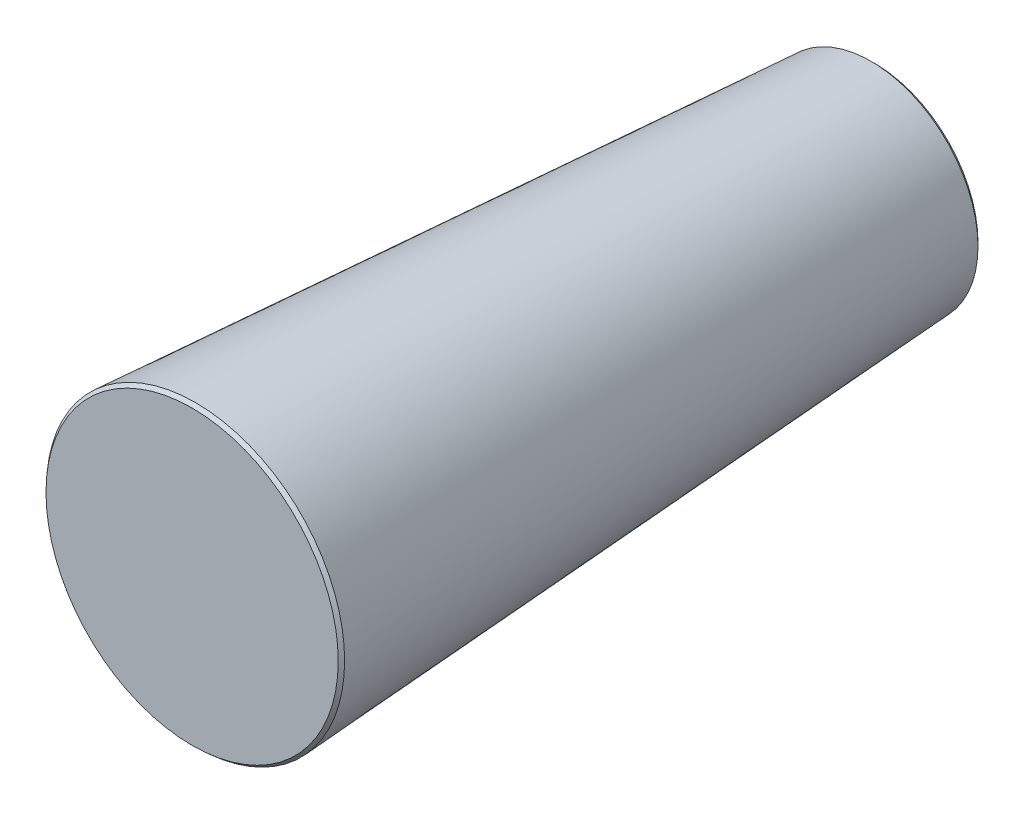
ISO-10303-21;
HEADER;
FILE_DESCRIPTION(('STEP AP214'),'2;1');
FILE_NAME('part.step','',(''),(''),'','','');
FILE_SCHEMA(('AUTOMOTIVE_DESIGN { 1 0 10303 214 1 1 1 1 }'));
ENDSEC;
DATA;
#1=APPLICATION_CONTEXT('core data for automotive mechanical design processes');
#2=APPLICATION_PROTOCOL_DEFINITION('international standard','automotive_design',2000,#1);
#3=PRODUCT_CONTEXT('',#1,'mechanical');
#4=PRODUCT('Part','Part','',(#3));
#5=PRODUCT_RELATED_PRODUCT_CATEGORY('part','',(#4));
#6=PRODUCT_DEFINITION_FORMATION('','',#4);
#7=PRODUCT_DEFINITION_CONTEXT('part definition',#1,'design');
#8=PRODUCT_DEFINITION('design','',#6,#7);
#9=PRODUCT_DEFINITION_SHAPE('','',#8);
#10=(LENGTH_UNIT() NAMED_UNIT(*) SI_UNIT(.MILLI.,.METRE.));
#11=(NAMED_UNIT(*) PLANE_ANGLE_UNIT() SI_UNIT($,.RADIAN.));
#12=(NAMED_UNIT(*) SI_UNIT($,.STERADIAN.) SOLID_ANGLE_UNIT());
#13=UNCERTAINTY_MEASURE_WITH_UNIT(LENGTH_MEASURE(1.E-05),#10,'distance_accuracy_value','');
#14=(GEOMETRIC_REPRESENTATION_CONTEXT(3) GLOBAL_UNCERTAINTY_ASSIGNED_CONTEXT((#13)) GLOBAL_UNIT_ASSIGNED_CONTEXT((#10,
#11,#12)) REPRESENTATION_CONTEXT('',''));
#15=CARTESIAN_POINT('',(0.,0.,0.));
#16=DIRECTION('',(0.,0.,1.));
#17=DIRECTION('',(1.,0.,0.));
#18=AXIS2_PLACEMENT_3D('',#15,#16,#17);
#19=CARTESIAN_POINT('',(0.,0.,0.));
#20=DIRECTION('',(0.,0.,1.));
#21=DIRECTION('',(1.,0.,0.));
#22=AXIS2_PLACEMENT_3D('',#19,#20,#21);
#23=PLANE('',#22);
#24=CARTESIAN_POINT('',(0.,0.,0.));
#25=DIRECTION('',(0.,0.,1.));
#26=DIRECTION('',(1.,0.,0.));
#27=AXIS2_PLACEMENT_3D('',#24,#25,#26);
#28=CIRCLE('',#27,7.68350000000003);
#29=CARTESIAN_POINT('',(7.68350000000003,0.,0.));
#30=VERTEX_POINT('',#29);
#31=EDGE_CURVE('E64',#30,#30,#28,.F.);
#32=ORIENTED_EDGE('',*,*,#31,.T.);
#33=EDGE_LOOP('',(#32));
#34=FACE_BOUND('',#33,.T.);
#35=ADVANCED_FACE('F57',(#34),#23,.F.);
#36=CARTESIAN_POINT('',(0.,0.,50.8));
#37=DIRECTION('',(0.,0.,1.));
#38=DIRECTION('',(1.,0.,0.));
#39=AXIS2_PLACEMENT_3D('',#36,#37,#38);
#40=PLANE('',#39);
#41=CARTESIAN_POINT('',(0.,0.,50.8));
#42=DIRECTION('',(0.,0.,1.));
#43=DIRECTION('',(1.,0.,0.));
#44=AXIS2_PLACEMENT_3D('',#41,#42,#43);
#45=CIRCLE('',#44,10.872974719786);
#46=CARTESIAN_POINT('',(10.872974719786,0.,50.8));
#47=VERTEX_POINT('',#46);
#48=EDGE_CURVE('E12',#47,#47,#45,.T.);
#49=ORIENTED_EDGE('',*,*,#48,.T.);
#50=EDGE_LOOP('',(#49));
#51=FACE_BOUND('',#50,.T.);
#52=ADVANCED_FACE('F88',(#51),#40,.T.);
#53=CARTESIAN_POINT('',(0.,0.,50.8));
#54=DIRECTION('',(0.,0.,1.));
#55=DIRECTION('',(1.,0.,0.));
#56=AXIS2_PLACEMENT_3D('',#53,#54,#55);
#57=CONICAL_SURFACE('',#56,11.1125,0.0624188099959571);
#58=CARTESIAN_POINT('',(0.,0.,0.270933333333305));
#59=DIRECTION('',(0.,0.,1.));
#60=DIRECTION('',(1.,0.,0.));
#61=AXIS2_PLACEMENT_3D('',#58,#59,#60);
#62=CIRCLE('',#61,7.95443333333334);
#63=CARTESIAN_POINT('',(7.95443333333334,0.,0.270933333333305));
#64=VERTEX_POINT('',#63);
#65=EDGE_CURVE('E68',#64,#64,#62,.T.);
#66=ORIENTED_EDGE('',*,*,#65,.T.);
#67=EDGE_LOOP('',(#66));
#68=FACE_BOUND('',#67,.T.);
#69=CARTESIAN_POINT('',(0.,0.,50.5464946450654));
#70=DIRECTION('',(0.,0.,-1.));
#71=DIRECTION('',(-1.,0.,0.));
#72=AXIS2_PLACEMENT_3D('',#69,#70,#71);
#73=CIRCLE('',#72,11.0966559153166);
#74=CARTESIAN_POINT('',(-11.0966559153166,0.,50.5464946450654));
#75=VERTEX_POINT('',#74);
#76=EDGE_CURVE('E72',#75,#75,#73,.T.);
#77=ORIENTED_EDGE('',*,*,#76,.T.);
#78=EDGE_LOOP('',(#77));
#79=FACE_BOUND('',#78,.T.);
#80=ADVANCED_FACE('F78',(#68,#79),#57,.T.);
#81=CARTESIAN_POINT('',(0.,0.,0.270933333333306));
#82=DIRECTION('',(0.,0.,1.));
#83=DIRECTION('',(1.,0.,0.));
#84=AXIS2_PLACEMENT_3D('',#81,#82,#83);
#85=CONICAL_SURFACE('',#84,7.95443333333334,0.785398163397461);
#86=ORIENTED_EDGE('',*,*,#31,.F.);
#87=EDGE_LOOP('',(#86));
#88=FACE_BOUND('',#87,.T.);
#89=ORIENTED_EDGE('',*,*,#65,.F.);
#90=EDGE_LOOP('',(#89));
#91=FACE_BOUND('',#90,.T.);
#92=ADVANCED_FACE('F82',(#88,#91),#85,.T.);
#93=CARTESIAN_POINT('',(0.,0.,50.8));
#94=DIRECTION('',(0.,0.,-1.));
#95=DIRECTION('',(-1.,0.,0.));
#96=AXIS2_PLACEMENT_3D('',#93,#94,#95);
#97=CONICAL_SURFACE('',#96,10.872974719786,0.722979353401488);
#98=ORIENTED_EDGE('',*,*,#76,.F.);
#99=EDGE_LOOP('',(#98));
#100=FACE_BOUND('',#99,.T.);
#101=ORIENTED_EDGE('',*,*,#48,.F.);
#102=EDGE_LOOP('',(#101));
#103=FACE_BOUND('',#102,.T.);
#104=ADVANCED_FACE('F59',(#100,#103),#97,.T.);
#105=CLOSED_SHELL('',(#35,#52,#80,#92,#104));
#106=MANIFOLD_SOLID_BREP('B2',#105);
#107=ADVANCED_BREP_SHAPE_REPRESENTATION('',(#18,#106),#14);
#108=SHAPE_DEFINITION_REPRESENTATION(#9,#107);
ENDSEC;
END-ISO-10303-21;
